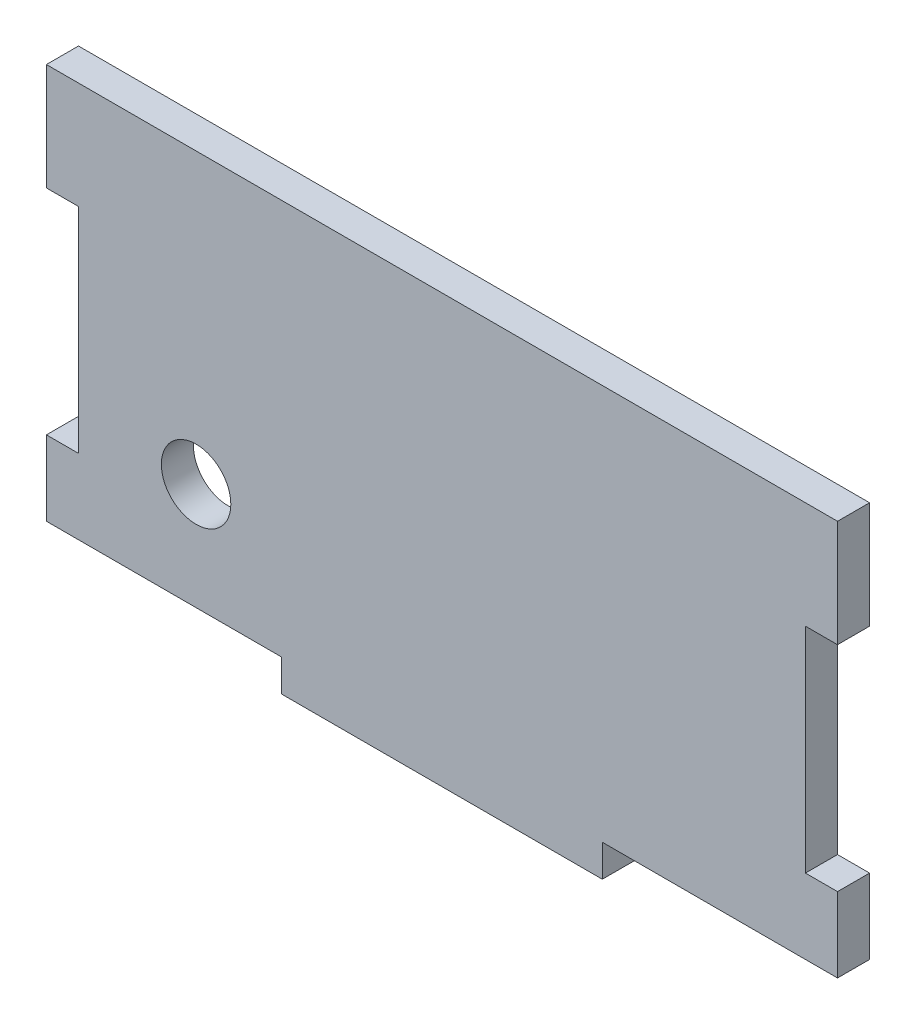
ISO-10303-21;
HEADER;
FILE_DESCRIPTION(('STEP AP214'),'2;1');
FILE_NAME('part.step','',(''),(''),'','','');
FILE_SCHEMA(('AUTOMOTIVE_DESIGN { 1 0 10303 214 1 1 1 1 }'));
ENDSEC;
DATA;
#1=APPLICATION_CONTEXT('core data for automotive mechanical design processes');
#2=APPLICATION_PROTOCOL_DEFINITION('international standard','automotive_design',2000,#1);
#3=PRODUCT_CONTEXT('',#1,'mechanical');
#4=PRODUCT('Part','Part','',(#3));
#5=PRODUCT_RELATED_PRODUCT_CATEGORY('part','',(#4));
#6=PRODUCT_DEFINITION_FORMATION('','',#4);
#7=PRODUCT_DEFINITION_CONTEXT('part definition',#1,'design');
#8=PRODUCT_DEFINITION('design','',#6,#7);
#9=PRODUCT_DEFINITION_SHAPE('','',#8);
#10=(LENGTH_UNIT() NAMED_UNIT(*) SI_UNIT(.MILLI.,.METRE.));
#11=(NAMED_UNIT(*) PLANE_ANGLE_UNIT() SI_UNIT($,.RADIAN.));
#12=(NAMED_UNIT(*) SI_UNIT($,.STERADIAN.) SOLID_ANGLE_UNIT());
#13=UNCERTAINTY_MEASURE_WITH_UNIT(LENGTH_MEASURE(1.E-05),#10,'distance_accuracy_value','');
#14=(GEOMETRIC_REPRESENTATION_CONTEXT(3) GLOBAL_UNCERTAINTY_ASSIGNED_CONTEXT((#13)) GLOBAL_UNIT_ASSIGNED_CONTEXT((#10,
#11,#12)) REPRESENTATION_CONTEXT('',''));
#15=CARTESIAN_POINT('',(0.,0.,0.));
#16=DIRECTION('',(0.,0.,1.));
#17=DIRECTION('',(1.,0.,0.));
#18=AXIS2_PLACEMENT_3D('',#15,#16,#17);
#19=CARTESIAN_POINT('',(37.,-20.,3.));
#20=DIRECTION('',(-1.,0.,0.));
#21=DIRECTION('',(0.,0.,1.));
#22=AXIS2_PLACEMENT_3D('',#19,#20,#21);
#23=PLANE('',#22);
#24=DIRECTION('',(0.,1.,0.));
#25=VECTOR('',#24,1.);
#26=CARTESIAN_POINT('',(37.,-20.,3.));
#27=LINE('',#26,#25);
#28=CARTESIAN_POINT('',(37.,10.,3.));
#29=VERTEX_POINT('',#28);
#30=CARTESIAN_POINT('',(37.,20.,3.));
#31=VERTEX_POINT('',#30);
#32=EDGE_CURVE('E168',#29,#31,#27,.T.);
#33=ORIENTED_EDGE('',*,*,#32,.F.);
#34=DIRECTION('',(0.,0.,1.));
#35=VECTOR('',#34,1.);
#36=CARTESIAN_POINT('',(37.,10.,0.));
#37=LINE('',#36,#35);
#38=CARTESIAN_POINT('',(37.,10.,0.));
#39=VERTEX_POINT('',#38);
#40=EDGE_CURVE('E153',#39,#29,#37,.T.);
#41=ORIENTED_EDGE('',*,*,#40,.F.);
#42=DIRECTION('',(0.,1.,0.));
#43=VECTOR('',#42,1.);
#44=CARTESIAN_POINT('',(37.,-20.,0.));
#45=LINE('',#44,#43);
#46=CARTESIAN_POINT('',(37.,20.,0.));
#47=VERTEX_POINT('',#46);
#48=EDGE_CURVE('E195',#39,#47,#45,.T.);
#49=ORIENTED_EDGE('',*,*,#48,.T.);
#50=DIRECTION('',(0.,0.,-1.));
#51=VECTOR('',#50,1.);
#52=CARTESIAN_POINT('',(37.,20.,3.));
#53=LINE('',#52,#51);
#54=EDGE_CURVE('E11',#31,#47,#53,.T.);
#55=ORIENTED_EDGE('',*,*,#54,.F.);
#56=EDGE_LOOP('',(#33,#41,#49,#55));
#57=FACE_BOUND('',#56,.T.);
#58=ADVANCED_FACE('F39',(#57),#23,.F.);
#59=CARTESIAN_POINT('',(-37.,-20.,3.));
#60=DIRECTION('',(1.,0.,0.));
#61=DIRECTION('',(0.,0.,-1.));
#62=AXIS2_PLACEMENT_3D('',#59,#60,#61);
#63=PLANE('',#62);
#64=DIRECTION('',(0.,-1.,0.));
#65=VECTOR('',#64,1.);
#66=CARTESIAN_POINT('',(-37.,-20.,0.));
#67=LINE('',#66,#65);
#68=CARTESIAN_POINT('',(-37.,20.,0.));
#69=VERTEX_POINT('',#68);
#70=CARTESIAN_POINT('',(-37.,10.,0.));
#71=VERTEX_POINT('',#70);
#72=EDGE_CURVE('E182',#69,#71,#67,.T.);
#73=ORIENTED_EDGE('',*,*,#72,.T.);
#74=DIRECTION('',(0.,0.,1.));
#75=VECTOR('',#74,1.);
#76=CARTESIAN_POINT('',(-37.,10.,0.));
#77=LINE('',#76,#75);
#78=CARTESIAN_POINT('',(-37.,10.,3.));
#79=VERTEX_POINT('',#78);
#80=EDGE_CURVE('E173',#71,#79,#77,.T.);
#81=ORIENTED_EDGE('',*,*,#80,.T.);
#82=DIRECTION('',(0.,-1.,0.));
#83=VECTOR('',#82,1.);
#84=CARTESIAN_POINT('',(-37.,-20.,3.));
#85=LINE('',#84,#83);
#86=CARTESIAN_POINT('',(-37.,20.,3.));
#87=VERTEX_POINT('',#86);
#88=EDGE_CURVE('E190',#87,#79,#85,.T.);
#89=ORIENTED_EDGE('',*,*,#88,.F.);
#90=DIRECTION('',(0.,0.,-1.));
#91=VECTOR('',#90,1.);
#92=CARTESIAN_POINT('',(-37.,20.,3.));
#93=LINE('',#92,#91);
#94=EDGE_CURVE('E48',#87,#69,#93,.T.);
#95=ORIENTED_EDGE('',*,*,#94,.T.);
#96=EDGE_LOOP('',(#73,#81,#89,#95));
#97=FACE_BOUND('',#96,.T.);
#98=ADVANCED_FACE('F209',(#97),#63,.F.);
#99=CARTESIAN_POINT('',(37.,-17.,3.));
#100=VERTEX_POINT('',#99);
#101=CARTESIAN_POINT('',(37.,-9.99999999999999,3.));
#102=VERTEX_POINT('',#101);
#103=EDGE_CURVE('E176',#100,#102,#27,.T.);
#104=ORIENTED_EDGE('',*,*,#103,.F.);
#105=DIRECTION('',(0.,0.,1.));
#106=VECTOR('',#105,1.);
#107=CARTESIAN_POINT('',(37.,-17.,0.));
#108=LINE('',#107,#106);
#109=CARTESIAN_POINT('',(37.,-17.,0.));
#110=VERTEX_POINT('',#109);
#111=EDGE_CURVE('E292',#110,#100,#108,.T.);
#112=ORIENTED_EDGE('',*,*,#111,.F.);
#113=CARTESIAN_POINT('',(37.,-9.99999999999999,0.));
#114=VERTEX_POINT('',#113);
#115=EDGE_CURVE('E197',#110,#114,#45,.T.);
#116=ORIENTED_EDGE('',*,*,#115,.T.);
#117=DIRECTION('',(0.,0.,1.));
#118=VECTOR('',#117,1.);
#119=CARTESIAN_POINT('',(37.,-9.99999999999999,0.));
#120=LINE('',#119,#118);
#121=EDGE_CURVE('E163',#114,#102,#120,.T.);
#122=ORIENTED_EDGE('',*,*,#121,.T.);
#123=EDGE_LOOP('',(#104,#112,#116,#122));
#124=FACE_BOUND('',#123,.T.);
#125=ADVANCED_FACE('F41',(#124),#23,.F.);
#126=CARTESIAN_POINT('',(-37.,20.,3.));
#127=DIRECTION('',(0.,-1.,0.));
#128=DIRECTION('',(0.,0.,-1.));
#129=AXIS2_PLACEMENT_3D('',#126,#127,#128);
#130=PLANE('',#129);
#131=DIRECTION('',(-1.,0.,0.));
#132=VECTOR('',#131,1.);
#133=CARTESIAN_POINT('',(-37.,20.,0.));
#134=LINE('',#133,#132);
#135=EDGE_CURVE('E199',#47,#69,#134,.T.);
#136=ORIENTED_EDGE('',*,*,#135,.T.);
#137=ORIENTED_EDGE('',*,*,#94,.F.);
#138=DIRECTION('',(-1.,0.,0.));
#139=VECTOR('',#138,1.);
#140=CARTESIAN_POINT('',(-37.,20.,3.));
#141=LINE('',#140,#139);
#142=EDGE_CURVE('E180',#31,#87,#141,.T.);
#143=ORIENTED_EDGE('',*,*,#142,.F.);
#144=ORIENTED_EDGE('',*,*,#54,.T.);
#145=EDGE_LOOP('',(#136,#137,#143,#144));
#146=FACE_BOUND('',#145,.T.);
#147=ADVANCED_FACE('F339',(#146),#130,.F.);
#148=CARTESIAN_POINT('',(-37.,-10.,3.));
#149=VERTEX_POINT('',#148);
#150=CARTESIAN_POINT('',(-37.,-17.,3.));
#151=VERTEX_POINT('',#150);
#152=EDGE_CURVE('E189',#149,#151,#85,.T.);
#153=ORIENTED_EDGE('',*,*,#152,.F.);
#154=DIRECTION('',(0.,0.,1.));
#155=VECTOR('',#154,1.);
#156=CARTESIAN_POINT('',(-37.,-10.,0.));
#157=LINE('',#156,#155);
#158=CARTESIAN_POINT('',(-37.,-10.,0.));
#159=VERTEX_POINT('',#158);
#160=EDGE_CURVE('E220',#159,#149,#157,.T.);
#161=ORIENTED_EDGE('',*,*,#160,.F.);
#162=CARTESIAN_POINT('',(-37.,-17.,0.));
#163=VERTEX_POINT('',#162);
#164=EDGE_CURVE('E201',#159,#163,#67,.T.);
#165=ORIENTED_EDGE('',*,*,#164,.T.);
#166=DIRECTION('',(0.,0.,1.));
#167=VECTOR('',#166,1.);
#168=CARTESIAN_POINT('',(-37.,-17.,0.));
#169=LINE('',#168,#167);
#170=EDGE_CURVE('E244',#163,#151,#169,.T.);
#171=ORIENTED_EDGE('',*,*,#170,.T.);
#172=EDGE_LOOP('',(#153,#161,#165,#171));
#173=FACE_BOUND('',#172,.T.);
#174=ADVANCED_FACE('F263',(#173),#63,.F.);
#175=CARTESIAN_POINT('',(-37.,-20.,3.));
#176=DIRECTION('',(0.,1.,0.));
#177=DIRECTION('',(0.,0.,1.));
#178=AXIS2_PLACEMENT_3D('',#175,#176,#177);
#179=PLANE('',#178);
#180=DIRECTION('',(1.,0.,0.));
#181=VECTOR('',#180,1.);
#182=CARTESIAN_POINT('',(-37.,-20.,0.));
#183=LINE('',#182,#181);
#184=CARTESIAN_POINT('',(-15.,-20.,0.));
#185=VERTEX_POINT('',#184);
#186=CARTESIAN_POINT('',(15.,-20.,0.));
#187=VERTEX_POINT('',#186);
#188=EDGE_CURVE('E177',#185,#187,#183,.T.);
#189=ORIENTED_EDGE('',*,*,#188,.T.);
#190=DIRECTION('',(0.,0.,1.));
#191=VECTOR('',#190,1.);
#192=CARTESIAN_POINT('',(15.,-20.,0.));
#193=LINE('',#192,#191);
#194=CARTESIAN_POINT('',(15.,-20.,3.));
#195=VERTEX_POINT('',#194);
#196=EDGE_CURVE('E270',#187,#195,#193,.T.);
#197=ORIENTED_EDGE('',*,*,#196,.T.);
#198=DIRECTION('',(1.,0.,0.));
#199=VECTOR('',#198,1.);
#200=CARTESIAN_POINT('',(-37.,-20.,3.));
#201=LINE('',#200,#199);
#202=CARTESIAN_POINT('',(-15.,-20.,3.));
#203=VERTEX_POINT('',#202);
#204=EDGE_CURVE('E193',#203,#195,#201,.T.);
#205=ORIENTED_EDGE('',*,*,#204,.F.);
#206=DIRECTION('',(0.,0.,1.));
#207=VECTOR('',#206,1.);
#208=CARTESIAN_POINT('',(-15.,-20.,0.));
#209=LINE('',#208,#207);
#210=EDGE_CURVE('E198',#185,#203,#209,.T.);
#211=ORIENTED_EDGE('',*,*,#210,.F.);
#212=EDGE_LOOP('',(#189,#197,#205,#211));
#213=FACE_BOUND('',#212,.T.);
#214=ADVANCED_FACE('F268',(#213),#179,.F.);
#215=CARTESIAN_POINT('',(0.,0.,3.));
#216=DIRECTION('',(0.,0.,-1.));
#217=DIRECTION('',(-1.,0.,0.));
#218=AXIS2_PLACEMENT_3D('',#215,#216,#217);
#219=PLANE('',#218);
#220=CARTESIAN_POINT('',(-23.,-7.00000000000001,3.));
#221=DIRECTION('',(0.,0.,1.));
#222=DIRECTION('',(1.,0.,0.));
#223=AXIS2_PLACEMENT_3D('',#220,#221,#222);
#224=CIRCLE('',#223,3.25);
#225=CARTESIAN_POINT('',(-19.75,-7.00000000000001,3.));
#226=VERTEX_POINT('',#225);
#227=EDGE_CURVE('E312',#226,#226,#224,.T.);
#228=ORIENTED_EDGE('',*,*,#227,.F.);
#229=EDGE_LOOP('',(#228));
#230=FACE_BOUND('',#229,.T.);
#231=ORIENTED_EDGE('',*,*,#204,.T.);
#232=DIRECTION('',(0.,-1.,0.));
#233=VECTOR('',#232,1.);
#234=CARTESIAN_POINT('',(15.,-17.,3.));
#235=LINE('',#234,#233);
#236=CARTESIAN_POINT('',(15.,-17.,3.));
#237=VERTEX_POINT('',#236);
#238=EDGE_CURVE('E242',#237,#195,#235,.T.);
#239=ORIENTED_EDGE('',*,*,#238,.F.);
#240=DIRECTION('',(-1.,0.,0.));
#241=VECTOR('',#240,1.);
#242=CARTESIAN_POINT('',(15.,-17.,3.));
#243=LINE('',#242,#241);
#244=EDGE_CURVE('E274',#100,#237,#243,.T.);
#245=ORIENTED_EDGE('',*,*,#244,.F.);
#246=ORIENTED_EDGE('',*,*,#103,.T.);
#247=DIRECTION('',(1.,0.,0.));
#248=VECTOR('',#247,1.);
#249=CARTESIAN_POINT('',(37.,-9.99999999999999,3.));
#250=LINE('',#249,#248);
#251=CARTESIAN_POINT('',(34.,-9.99999999999999,3.));
#252=VERTEX_POINT('',#251);
#253=EDGE_CURVE('E297',#252,#102,#250,.T.);
#254=ORIENTED_EDGE('',*,*,#253,.F.);
#255=DIRECTION('',(0.,-1.,0.));
#256=VECTOR('',#255,1.);
#257=CARTESIAN_POINT('',(34.,10.,3.));
#258=LINE('',#257,#256);
#259=CARTESIAN_POINT('',(34.,10.,3.));
#260=VERTEX_POINT('',#259);
#261=EDGE_CURVE('E172',#260,#252,#258,.T.);
#262=ORIENTED_EDGE('',*,*,#261,.F.);
#263=DIRECTION('',(-1.,0.,0.));
#264=VECTOR('',#263,1.);
#265=CARTESIAN_POINT('',(37.,10.,3.));
#266=LINE('',#265,#264);
#267=EDGE_CURVE('E156',#29,#260,#266,.T.);
#268=ORIENTED_EDGE('',*,*,#267,.F.);
#269=ORIENTED_EDGE('',*,*,#32,.T.);
#270=ORIENTED_EDGE('',*,*,#142,.T.);
#271=ORIENTED_EDGE('',*,*,#88,.T.);
#272=DIRECTION('',(-1.,0.,0.));
#273=VECTOR('',#272,1.);
#274=CARTESIAN_POINT('',(-37.,10.,3.));
#275=LINE('',#274,#273);
#276=CARTESIAN_POINT('',(-34.,10.,3.));
#277=VERTEX_POINT('',#276);
#278=EDGE_CURVE('E231',#277,#79,#275,.T.);
#279=ORIENTED_EDGE('',*,*,#278,.F.);
#280=DIRECTION('',(0.,1.,0.));
#281=VECTOR('',#280,1.);
#282=CARTESIAN_POINT('',(-34.,10.,3.));
#283=LINE('',#282,#281);
#284=CARTESIAN_POINT('',(-34.,-10.,3.));
#285=VERTEX_POINT('',#284);
#286=EDGE_CURVE('E288',#285,#277,#283,.T.);
#287=ORIENTED_EDGE('',*,*,#286,.F.);
#288=DIRECTION('',(1.,0.,0.));
#289=VECTOR('',#288,1.);
#290=CARTESIAN_POINT('',(-37.,-10.,3.));
#291=LINE('',#290,#289);
#292=EDGE_CURVE('E227',#149,#285,#291,.T.);
#293=ORIENTED_EDGE('',*,*,#292,.F.);
#294=ORIENTED_EDGE('',*,*,#152,.T.);
#295=DIRECTION('',(-1.,0.,0.));
#296=VECTOR('',#295,1.);
#297=CARTESIAN_POINT('',(-15.,-17.,3.));
#298=LINE('',#297,#296);
#299=CARTESIAN_POINT('',(-15.,-17.,3.));
#300=VERTEX_POINT('',#299);
#301=EDGE_CURVE('E236',#300,#151,#298,.T.);
#302=ORIENTED_EDGE('',*,*,#301,.F.);
#303=DIRECTION('',(0.,1.,0.));
#304=VECTOR('',#303,1.);
#305=CARTESIAN_POINT('',(-15.,-20.,3.));
#306=LINE('',#305,#304);
#307=EDGE_CURVE('E239',#203,#300,#306,.T.);
#308=ORIENTED_EDGE('',*,*,#307,.F.);
#309=EDGE_LOOP('',(#231,#239,#245,#246,#254,#262,#268,#269,#270,#271,#279,#287,#293,#294,#302,#308));
#310=FACE_BOUND('',#309,.T.);
#311=ADVANCED_FACE('F167',(#230,#310),#219,.F.);
#312=CARTESIAN_POINT('',(0.,0.,0.));
#313=DIRECTION('',(0.,0.,-1.));
#314=DIRECTION('',(-1.,0.,0.));
#315=AXIS2_PLACEMENT_3D('',#312,#313,#314);
#316=PLANE('',#315);
#317=CARTESIAN_POINT('',(-23.,-7.00000000000001,0.));
#318=DIRECTION('',(0.,0.,-1.));
#319=DIRECTION('',(-1.,0.,0.));
#320=AXIS2_PLACEMENT_3D('',#317,#318,#319);
#321=CIRCLE('',#320,3.25);
#322=CARTESIAN_POINT('',(-26.25,-7.00000000000001,0.));
#323=VERTEX_POINT('',#322);
#324=EDGE_CURVE('E43',#323,#323,#321,.T.);
#325=ORIENTED_EDGE('',*,*,#324,.F.);
#326=EDGE_LOOP('',(#325));
#327=FACE_BOUND('',#326,.T.);
#328=DIRECTION('',(0.,-1.,0.));
#329=VECTOR('',#328,1.);
#330=CARTESIAN_POINT('',(15.,-17.,0.));
#331=LINE('',#330,#329);
#332=CARTESIAN_POINT('',(15.,-17.,0.));
#333=VERTEX_POINT('',#332);
#334=EDGE_CURVE('E55',#333,#187,#331,.T.);
#335=ORIENTED_EDGE('',*,*,#334,.T.);
#336=ORIENTED_EDGE('',*,*,#188,.F.);
#337=DIRECTION('',(0.,1.,0.));
#338=VECTOR('',#337,1.);
#339=CARTESIAN_POINT('',(-15.,-20.,0.));
#340=LINE('',#339,#338);
#341=CARTESIAN_POINT('',(-15.,-17.,0.));
#342=VERTEX_POINT('',#341);
#343=EDGE_CURVE('E232',#185,#342,#340,.T.);
#344=ORIENTED_EDGE('',*,*,#343,.T.);
#345=DIRECTION('',(-1.,0.,0.));
#346=VECTOR('',#345,1.);
#347=CARTESIAN_POINT('',(-15.,-17.,0.));
#348=LINE('',#347,#346);
#349=EDGE_CURVE('E235',#342,#163,#348,.T.);
#350=ORIENTED_EDGE('',*,*,#349,.T.);
#351=ORIENTED_EDGE('',*,*,#164,.F.);
#352=DIRECTION('',(1.,0.,0.));
#353=VECTOR('',#352,1.);
#354=CARTESIAN_POINT('',(-37.,-10.,0.));
#355=LINE('',#354,#353);
#356=CARTESIAN_POINT('',(-34.,-10.,0.));
#357=VERTEX_POINT('',#356);
#358=EDGE_CURVE('E222',#159,#357,#355,.T.);
#359=ORIENTED_EDGE('',*,*,#358,.T.);
#360=DIRECTION('',(0.,1.,0.));
#361=VECTOR('',#360,1.);
#362=CARTESIAN_POINT('',(-34.,10.,0.));
#363=LINE('',#362,#361);
#364=CARTESIAN_POINT('',(-34.,10.,0.));
#365=VERTEX_POINT('',#364);
#366=EDGE_CURVE('E63',#357,#365,#363,.T.);
#367=ORIENTED_EDGE('',*,*,#366,.T.);
#368=DIRECTION('',(-1.,0.,0.));
#369=VECTOR('',#368,1.);
#370=CARTESIAN_POINT('',(-37.,10.,0.));
#371=LINE('',#370,#369);
#372=EDGE_CURVE('E217',#365,#71,#371,.T.);
#373=ORIENTED_EDGE('',*,*,#372,.T.);
#374=ORIENTED_EDGE('',*,*,#72,.F.);
#375=ORIENTED_EDGE('',*,*,#135,.F.);
#376=ORIENTED_EDGE('',*,*,#48,.F.);
#377=DIRECTION('',(-1.,0.,0.));
#378=VECTOR('',#377,1.);
#379=CARTESIAN_POINT('',(37.,10.,0.));
#380=LINE('',#379,#378);
#381=CARTESIAN_POINT('',(34.,10.,0.));
#382=VERTEX_POINT('',#381);
#383=EDGE_CURVE('E159',#39,#382,#380,.T.);
#384=ORIENTED_EDGE('',*,*,#383,.T.);
#385=DIRECTION('',(0.,-1.,0.));
#386=VECTOR('',#385,1.);
#387=CARTESIAN_POINT('',(34.,10.,0.));
#388=LINE('',#387,#386);
#389=CARTESIAN_POINT('',(34.,-9.99999999999999,0.));
#390=VERTEX_POINT('',#389);
#391=EDGE_CURVE('E298',#382,#390,#388,.T.);
#392=ORIENTED_EDGE('',*,*,#391,.T.);
#393=DIRECTION('',(1.,0.,0.));
#394=VECTOR('',#393,1.);
#395=CARTESIAN_POINT('',(37.,-9.99999999999999,0.));
#396=LINE('',#395,#394);
#397=EDGE_CURVE('E301',#390,#114,#396,.T.);
#398=ORIENTED_EDGE('',*,*,#397,.T.);
#399=ORIENTED_EDGE('',*,*,#115,.F.);
#400=DIRECTION('',(-1.,0.,0.));
#401=VECTOR('',#400,1.);
#402=CARTESIAN_POINT('',(15.,-17.,0.));
#403=LINE('',#402,#401);
#404=EDGE_CURVE('E280',#110,#333,#403,.T.);
#405=ORIENTED_EDGE('',*,*,#404,.T.);
#406=EDGE_LOOP('',(#335,#336,#344,#350,#351,#359,#367,#373,#374,#375,#376,#384,#392,#398,#399,#405));
#407=FACE_BOUND('',#406,.T.);
#408=ADVANCED_FACE('F215',(#327,#407),#316,.T.);
#409=CARTESIAN_POINT('',(-15.,-20.,0.));
#410=DIRECTION('',(1.,0.,0.));
#411=DIRECTION('',(0.,0.,-1.));
#412=AXIS2_PLACEMENT_3D('',#409,#410,#411);
#413=PLANE('',#412);
#414=ORIENTED_EDGE('',*,*,#307,.T.);
#415=DIRECTION('',(0.,0.,1.));
#416=VECTOR('',#415,1.);
#417=CARTESIAN_POINT('',(-15.,-17.,0.));
#418=LINE('',#417,#416);
#419=EDGE_CURVE('E186',#342,#300,#418,.T.);
#420=ORIENTED_EDGE('',*,*,#419,.F.);
#421=ORIENTED_EDGE('',*,*,#343,.F.);
#422=ORIENTED_EDGE('',*,*,#210,.T.);
#423=EDGE_LOOP('',(#414,#420,#421,#422));
#424=FACE_BOUND('',#423,.T.);
#425=ADVANCED_FACE('F256',(#424),#413,.F.);
#426=CARTESIAN_POINT('',(-15.,-17.,0.));
#427=DIRECTION('',(0.,1.,0.));
#428=DIRECTION('',(-1.,0.,0.));
#429=AXIS2_PLACEMENT_3D('',#426,#427,#428);
#430=PLANE('',#429);
#431=ORIENTED_EDGE('',*,*,#301,.T.);
#432=ORIENTED_EDGE('',*,*,#170,.F.);
#433=ORIENTED_EDGE('',*,*,#349,.F.);
#434=ORIENTED_EDGE('',*,*,#419,.T.);
#435=EDGE_LOOP('',(#431,#432,#433,#434));
#436=FACE_BOUND('',#435,.T.);
#437=ADVANCED_FACE('F252',(#436),#430,.F.);
#438=CARTESIAN_POINT('',(37.,10.,0.));
#439=DIRECTION('',(0.,1.,0.));
#440=DIRECTION('',(0.,0.,1.));
#441=AXIS2_PLACEMENT_3D('',#438,#439,#440);
#442=PLANE('',#441);
#443=ORIENTED_EDGE('',*,*,#267,.T.);
#444=DIRECTION('',(0.,0.,1.));
#445=VECTOR('',#444,1.);
#446=CARTESIAN_POINT('',(34.,10.,0.));
#447=LINE('',#446,#445);
#448=EDGE_CURVE('E303',#382,#260,#447,.T.);
#449=ORIENTED_EDGE('',*,*,#448,.F.);
#450=ORIENTED_EDGE('',*,*,#383,.F.);
#451=ORIENTED_EDGE('',*,*,#40,.T.);
#452=EDGE_LOOP('',(#443,#449,#450,#451));
#453=FACE_BOUND('',#452,.T.);
#454=ADVANCED_FACE('F155',(#453),#442,.F.);
#455=CARTESIAN_POINT('',(37.,-9.99999999999999,0.));
#456=DIRECTION('',(0.,-1.,0.));
#457=DIRECTION('',(0.,0.,-1.));
#458=AXIS2_PLACEMENT_3D('',#455,#456,#457);
#459=PLANE('',#458);
#460=ORIENTED_EDGE('',*,*,#253,.T.);
#461=ORIENTED_EDGE('',*,*,#121,.F.);
#462=ORIENTED_EDGE('',*,*,#397,.F.);
#463=DIRECTION('',(0.,0.,1.));
#464=VECTOR('',#463,1.);
#465=CARTESIAN_POINT('',(34.,-9.99999999999999,0.));
#466=LINE('',#465,#464);
#467=EDGE_CURVE('E309',#390,#252,#466,.T.);
#468=ORIENTED_EDGE('',*,*,#467,.T.);
#469=EDGE_LOOP('',(#460,#461,#462,#468));
#470=FACE_BOUND('',#469,.T.);
#471=ADVANCED_FACE('F348',(#470),#459,.F.);
#472=CARTESIAN_POINT('',(34.,10.,0.));
#473=DIRECTION('',(-1.,0.,0.));
#474=DIRECTION('',(0.,-1.,0.));
#475=AXIS2_PLACEMENT_3D('',#472,#473,#474);
#476=PLANE('',#475);
#477=ORIENTED_EDGE('',*,*,#261,.T.);
#478=ORIENTED_EDGE('',*,*,#467,.F.);
#479=ORIENTED_EDGE('',*,*,#391,.F.);
#480=ORIENTED_EDGE('',*,*,#448,.T.);
#481=EDGE_LOOP('',(#477,#478,#479,#480));
#482=FACE_BOUND('',#481,.T.);
#483=ADVANCED_FACE('F352',(#482),#476,.F.);
#484=CARTESIAN_POINT('',(-37.,10.,0.));
#485=DIRECTION('',(0.,1.,0.));
#486=DIRECTION('',(0.,0.,1.));
#487=AXIS2_PLACEMENT_3D('',#484,#485,#486);
#488=PLANE('',#487);
#489=ORIENTED_EDGE('',*,*,#278,.T.);
#490=ORIENTED_EDGE('',*,*,#80,.F.);
#491=ORIENTED_EDGE('',*,*,#372,.F.);
#492=DIRECTION('',(0.,0.,1.));
#493=VECTOR('',#492,1.);
#494=CARTESIAN_POINT('',(-34.,10.,0.));
#495=LINE('',#494,#493);
#496=EDGE_CURVE('E285',#365,#277,#495,.T.);
#497=ORIENTED_EDGE('',*,*,#496,.T.);
#498=EDGE_LOOP('',(#489,#490,#491,#497));
#499=FACE_BOUND('',#498,.T.);
#500=ADVANCED_FACE('F371',(#499),#488,.F.);
#501=CARTESIAN_POINT('',(-34.,10.,0.));
#502=DIRECTION('',(1.,0.,0.));
#503=DIRECTION('',(0.,0.,-1.));
#504=AXIS2_PLACEMENT_3D('',#501,#502,#503);
#505=PLANE('',#504);
#506=ORIENTED_EDGE('',*,*,#286,.T.);
#507=ORIENTED_EDGE('',*,*,#496,.F.);
#508=ORIENTED_EDGE('',*,*,#366,.F.);
#509=DIRECTION('',(0.,0.,1.));
#510=VECTOR('',#509,1.);
#511=CARTESIAN_POINT('',(-34.,-10.,0.));
#512=LINE('',#511,#510);
#513=EDGE_CURVE('E224',#357,#285,#512,.T.);
#514=ORIENTED_EDGE('',*,*,#513,.T.);
#515=EDGE_LOOP('',(#506,#507,#508,#514));
#516=FACE_BOUND('',#515,.T.);
#517=ADVANCED_FACE('F368',(#516),#505,.F.);
#518=CARTESIAN_POINT('',(-37.,-10.,0.));
#519=DIRECTION('',(0.,-1.,0.));
#520=DIRECTION('',(0.,0.,-1.));
#521=AXIS2_PLACEMENT_3D('',#518,#519,#520);
#522=PLANE('',#521);
#523=ORIENTED_EDGE('',*,*,#292,.T.);
#524=ORIENTED_EDGE('',*,*,#513,.F.);
#525=ORIENTED_EDGE('',*,*,#358,.F.);
#526=ORIENTED_EDGE('',*,*,#160,.T.);
#527=EDGE_LOOP('',(#523,#524,#525,#526));
#528=FACE_BOUND('',#527,.T.);
#529=ADVANCED_FACE('F362',(#528),#522,.F.);
#530=CARTESIAN_POINT('',(15.,-17.,0.));
#531=DIRECTION('',(-1.,0.,0.));
#532=DIRECTION('',(0.,-1.,0.));
#533=AXIS2_PLACEMENT_3D('',#530,#531,#532);
#534=PLANE('',#533);
#535=ORIENTED_EDGE('',*,*,#238,.T.);
#536=ORIENTED_EDGE('',*,*,#196,.F.);
#537=ORIENTED_EDGE('',*,*,#334,.F.);
#538=DIRECTION('',(0.,0.,1.));
#539=VECTOR('',#538,1.);
#540=CARTESIAN_POINT('',(15.,-17.,0.));
#541=LINE('',#540,#539);
#542=EDGE_CURVE('E291',#333,#237,#541,.T.);
#543=ORIENTED_EDGE('',*,*,#542,.T.);
#544=EDGE_LOOP('',(#535,#536,#537,#543));
#545=FACE_BOUND('',#544,.T.);
#546=ADVANCED_FACE('F356',(#545),#534,.F.);
#547=CARTESIAN_POINT('',(15.,-17.,0.));
#548=DIRECTION('',(0.,1.,0.));
#549=DIRECTION('',(-1.,0.,0.));
#550=AXIS2_PLACEMENT_3D('',#547,#548,#549);
#551=PLANE('',#550);
#552=ORIENTED_EDGE('',*,*,#244,.T.);
#553=ORIENTED_EDGE('',*,*,#542,.F.);
#554=ORIENTED_EDGE('',*,*,#404,.F.);
#555=ORIENTED_EDGE('',*,*,#111,.T.);
#556=EDGE_LOOP('',(#552,#553,#554,#555));
#557=FACE_BOUND('',#556,.T.);
#558=ADVANCED_FACE('F354',(#557),#551,.F.);
#559=CARTESIAN_POINT('',(-23.,-7.00000000000001,-7.));
#560=DIRECTION('',(0.,0.,1.));
#561=DIRECTION('',(1.,0.,0.));
#562=AXIS2_PLACEMENT_3D('',#559,#560,#561);
#563=CYLINDRICAL_SURFACE('',#562,3.25);
#564=ORIENTED_EDGE('',*,*,#324,.T.);
#565=EDGE_LOOP('',(#564));
#566=FACE_BOUND('',#565,.T.);
#567=ORIENTED_EDGE('',*,*,#227,.T.);
#568=EDGE_LOOP('',(#567));
#569=FACE_BOUND('',#568,.T.);
#570=ADVANCED_FACE('F319',(#566,#569),#563,.F.);
#571=CLOSED_SHELL('',(#58,#98,#125,#147,#174,#214,#311,#408,#425,#437,#454,#471,#483,#500,#517,
#529,#546,#558,#570));
#572=MANIFOLD_SOLID_BREP('B2',#571);
#573=ADVANCED_BREP_SHAPE_REPRESENTATION('',(#18,#572),#14);
#574=SHAPE_DEFINITION_REPRESENTATION(#9,#573);
ENDSEC;
END-ISO-10303-21;
